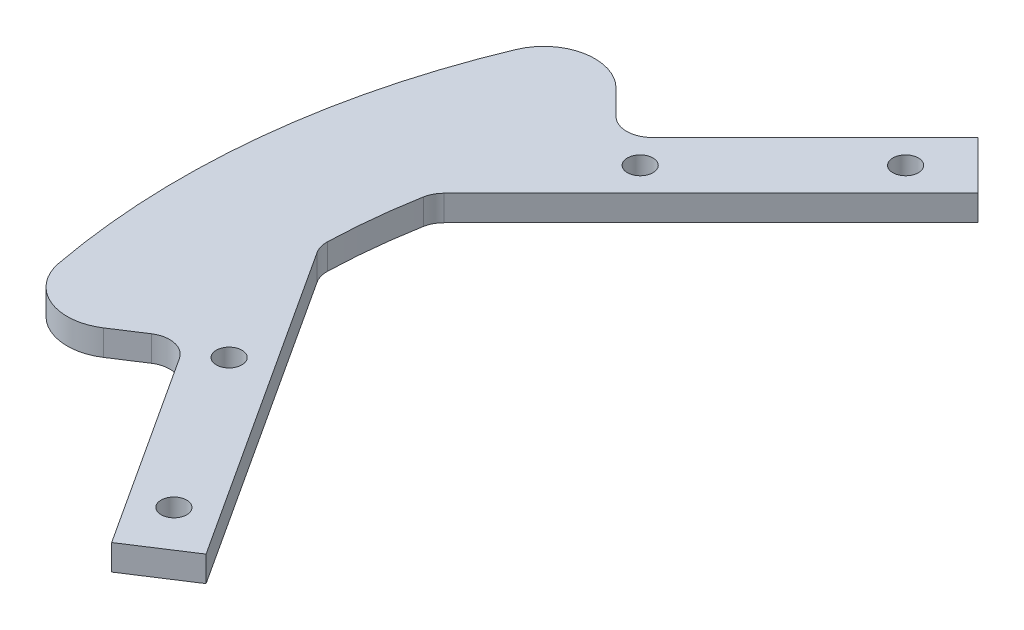
ISO-10303-21;
HEADER;
FILE_DESCRIPTION(('STEP AP214'),'2;1');
FILE_NAME('part.step','',(''),(''),'','','');
FILE_SCHEMA(('AUTOMOTIVE_DESIGN { 1 0 10303 214 1 1 1 1 }'));
ENDSEC;
DATA;
#1=APPLICATION_CONTEXT('core data for automotive mechanical design processes');
#2=APPLICATION_PROTOCOL_DEFINITION('international standard','automotive_design',2000,#1);
#3=PRODUCT_CONTEXT('',#1,'mechanical');
#4=PRODUCT('Part','Part','',(#3));
#5=PRODUCT_RELATED_PRODUCT_CATEGORY('part','',(#4));
#6=PRODUCT_DEFINITION_FORMATION('','',#4);
#7=PRODUCT_DEFINITION_CONTEXT('part definition',#1,'design');
#8=PRODUCT_DEFINITION('design','',#6,#7);
#9=PRODUCT_DEFINITION_SHAPE('','',#8);
#10=(LENGTH_UNIT() NAMED_UNIT(*) SI_UNIT(.MILLI.,.METRE.));
#11=(NAMED_UNIT(*) PLANE_ANGLE_UNIT() SI_UNIT($,.RADIAN.));
#12=(NAMED_UNIT(*) SI_UNIT($,.STERADIAN.) SOLID_ANGLE_UNIT());
#13=UNCERTAINTY_MEASURE_WITH_UNIT(LENGTH_MEASURE(1.E-05),#10,'distance_accuracy_value','');
#14=(GEOMETRIC_REPRESENTATION_CONTEXT(3) GLOBAL_UNCERTAINTY_ASSIGNED_CONTEXT((#13)) GLOBAL_UNIT_ASSIGNED_CONTEXT((#10,
#11,#12)) REPRESENTATION_CONTEXT('',''));
#15=CARTESIAN_POINT('',(0.,0.,0.));
#16=DIRECTION('',(0.,0.,1.));
#17=DIRECTION('',(1.,0.,0.));
#18=AXIS2_PLACEMENT_3D('',#15,#16,#17);
#19=CARTESIAN_POINT('',(0.,3.,0.));
#20=DIRECTION('',(0.,1.,0.));
#21=DIRECTION('',(0.,0.,1.));
#22=AXIS2_PLACEMENT_3D('',#19,#20,#21);
#23=PLANE('',#22);
#24=CARTESIAN_POINT('',(-51.9975752126165,3.,33.7676201709314));
#25=DIRECTION('',(0.,1.,0.));
#26=DIRECTION('',(0.,0.,1.));
#27=AXIS2_PLACEMENT_3D('',#24,#25,#26);
#28=CIRCLE('',#27,1.5);
#29=CARTESIAN_POINT('',(-51.9975752126165,3.,35.2676201709314));
#30=VERTEX_POINT('',#29);
#31=EDGE_CURVE('E523',#30,#30,#28,.T.);
#32=ORIENTED_EDGE('',*,*,#31,.F.);
#33=EDGE_LOOP('',(#32));
#34=FACE_BOUND('',#33,.T.);
#35=CARTESIAN_POINT('',(-43.8406204335662,3.,-43.8406204335657));
#36=DIRECTION('',(0.,1.,0.));
#37=DIRECTION('',(0.,0.,1.));
#38=AXIS2_PLACEMENT_3D('',#35,#36,#37);
#39=CIRCLE('',#38,1.5);
#40=CARTESIAN_POINT('',(-43.8406204335662,3.,-42.3406204335657));
#41=VERTEX_POINT('',#40);
#42=EDGE_CURVE('E192',#41,#41,#39,.T.);
#43=ORIENTED_EDGE('',*,*,#42,.F.);
#44=EDGE_LOOP('',(#43));
#45=FACE_BOUND('',#44,.T.);
#46=DIRECTION('',(-0.707106781186544,0.,0.707106781186551));
#47=VECTOR('',#46,1.);
#48=CARTESIAN_POINT('',(-63.6396103067894,3.,-29.6984848098347));
#49=LINE('',#48,#47);
#50=CARTESIAN_POINT('',(-42.4264068711931,3.,-50.9116882454312));
#51=VERTEX_POINT('',#50);
#52=CARTESIAN_POINT('',(-61.5182899632298,3.,-31.8198051533943));
#53=VERTEX_POINT('',#52);
#54=EDGE_CURVE('E183',#51,#53,#49,.T.);
#55=ORIENTED_EDGE('',*,*,#54,.T.);
#56=CARTESIAN_POINT('',(-63.6396103067894,3.,-33.941125496954));
#57=DIRECTION('',(0.,1.,0.));
#58=DIRECTION('',(0.,0.,1.));
#59=AXIS2_PLACEMENT_3D('',#56,#57,#58);
#60=CIRCLE('',#59,3.);
#61=CARTESIAN_POINT('',(-65.7609306503491,3.,-31.8198051533943));
#62=VERTEX_POINT('',#61);
#63=EDGE_CURVE('E266',#53,#62,#60,.F.);
#64=ORIENTED_EDGE('',*,*,#63,.T.);
#65=DIRECTION('',(-0.707106781186552,0.,-0.707106781186543));
#66=VECTOR('',#65,1.);
#67=CARTESIAN_POINT('',(-74.6290400089809,3.,-40.687914512026));
#68=LINE('',#67,#66);
#69=CARTESIAN_POINT('',(-68.6474434592942,3.,-34.7063179623394));
#70=VERTEX_POINT('',#69);
#71=EDGE_CURVE('E185',#62,#70,#68,.T.);
#72=ORIENTED_EDGE('',*,*,#71,.T.);
#73=CARTESIAN_POINT('',(-72.8900841464135,3.,-30.4636772752201));
#74=DIRECTION('',(0.,1.,0.));
#75=DIRECTION('',(0.,0.,1.));
#76=AXIS2_PLACEMENT_3D('',#73,#74,#75);
#77=CIRCLE('',#76,6.);
#78=CARTESIAN_POINT('',(-78.4260399043689,3.,-32.7773742834647));
#79=VERTEX_POINT('',#78);
#80=EDGE_CURVE('E233',#70,#79,#77,.T.);
#81=ORIENTED_EDGE('',*,*,#80,.T.);
#82=CARTESIAN_POINT('',(0.,3.,0.));
#83=DIRECTION('',(0.,1.,0.));
#84=DIRECTION('',(0.,0.,1.));
#85=AXIS2_PLACEMENT_3D('',#82,#83,#84);
#86=CIRCLE('',#85,85.);
#87=CARTESIAN_POINT('',(-83.5270420753539,3.,15.7554194530665));
#88=VERTEX_POINT('',#87);
#89=EDGE_CURVE('E212',#79,#88,#86,.T.);
#90=ORIENTED_EDGE('',*,*,#89,.T.);
#91=CARTESIAN_POINT('',(-77.6310155759171,3.,14.6432721975559));
#92=DIRECTION('',(0.,1.,0.));
#93=DIRECTION('',(0.,0.,1.));
#94=AXIS2_PLACEMENT_3D('',#91,#92,#93);
#95=CIRCLE('',#94,6.);
#96=CARTESIAN_POINT('',(-74.363181365827,3.,19.6752956052285));
#97=VERTEX_POINT('',#96);
#98=EDGE_CURVE('E231',#88,#97,#95,.T.);
#99=ORIENTED_EDGE('',*,*,#98,.T.);
#100=DIRECTION('',(0.838670567945427,0.,-0.544639035015022));
#101=VECTOR('',#100,1.);
#102=CARTESIAN_POINT('',(-68.4235943247587,3.,15.8180826803013));
#103=LINE('',#102,#101);
#104=CARTESIAN_POINT('',(-70.939606028595,3.,17.4519997853463));
#105=VERTEX_POINT('',#104);
#106=EDGE_CURVE('E157',#97,#105,#103,.T.);
#107=ORIENTED_EDGE('',*,*,#106,.T.);
#108=CARTESIAN_POINT('',(-69.3056889235499,3.,19.9680114891826));
#109=DIRECTION('',(0.,1.,0.));
#110=DIRECTION('',(0.,0.,1.));
#111=AXIS2_PLACEMENT_3D('',#108,#109,#110);
#112=CIRCLE('',#111,3.);
#113=CARTESIAN_POINT('',(-66.7896772197137,3.,18.3340943841376));
#114=VERTEX_POINT('',#113);
#115=EDGE_CURVE('E11',#105,#114,#112,.F.);
#116=ORIENTED_EDGE('',*,*,#115,.T.);
#117=DIRECTION('',(0.544639035015023,0.,0.838670567945427));
#118=VECTOR('',#117,1.);
#119=CARTESIAN_POINT('',(-52.0844232743081,3.,40.978199718664));
#120=LINE('',#119,#118);
#121=CARTESIAN_POINT('',(-52.0844232743081,3.,40.978199718664));
#122=VERTEX_POINT('',#121);
#123=EDGE_CURVE('E145',#114,#122,#120,.T.);
#124=ORIENTED_EDGE('',*,*,#123,.T.);
#125=DIRECTION('',(0.838670567945427,0.,-0.544639035015022));
#126=VECTOR('',#125,1.);
#127=CARTESIAN_POINT('',(-45.3750587307446,3.,36.6210874385439));
#128=LINE('',#127,#126);
#129=CARTESIAN_POINT('',(-45.3750587307446,3.,36.6210874385439));
#130=VERTEX_POINT('',#129);
#131=EDGE_CURVE('E151',#122,#130,#128,.T.);
#132=ORIENTED_EDGE('',*,*,#131,.T.);
#133=DIRECTION('',(-0.544639035015023,0.,-0.838670567945426));
#134=VECTOR('',#133,1.);
#135=CARTESIAN_POINT('',(-69.9882966174528,3.,-1.27997522923208));
#136=LINE('',#135,#134);
#137=CARTESIAN_POINT('',(-69.4820094592601,3.,-0.500361372701859));
#138=VERTEX_POINT('',#137);
#139=EDGE_CURVE('E171',#130,#138,#136,.T.);
#140=ORIENTED_EDGE('',*,*,#139,.T.);
#141=CARTESIAN_POINT('',(-66.9659977554238,3.,-2.13427847774693));
#142=DIRECTION('',(0.,1.,0.));
#143=DIRECTION('',(0.,0.,1.));
#144=AXIS2_PLACEMENT_3D('',#141,#142,#143);
#145=CIRCLE('',#144,3.);
#146=CARTESIAN_POINT('',(-69.9644752668607,3.,-2.22984318570574));
#147=VERTEX_POINT('',#146);
#148=EDGE_CURVE('E258',#138,#147,#145,.F.);
#149=ORIENTED_EDGE('',*,*,#148,.T.);
#150=CARTESIAN_POINT('',(0.,3.,0.));
#151=DIRECTION('',(0.,-1.,0.));
#152=DIRECTION('',(0.,0.,1.));
#153=AXIS2_PLACEMENT_3D('',#150,#151,#152);
#154=CIRCLE('',#153,70.);
#155=CARTESIAN_POINT('',(-68.899194085878,3.,-12.3653165877995));
#156=VERTEX_POINT('',#155);
#157=EDGE_CURVE('E173',#147,#156,#154,.T.);
#158=ORIENTED_EDGE('',*,*,#157,.T.);
#159=CARTESIAN_POINT('',(-65.9463714821975,3.,-11.8353744483224));
#160=DIRECTION('',(0.,1.,0.));
#161=DIRECTION('',(0.,0.,1.));
#162=AXIS2_PLACEMENT_3D('',#159,#160,#161);
#163=CIRCLE('',#162,3.);
#164=CARTESIAN_POINT('',(-68.0676918257572,3.,-13.956694791882));
#165=VERTEX_POINT('',#164);
#166=EDGE_CURVE('E262',#156,#165,#163,.F.);
#167=ORIENTED_EDGE('',*,*,#166,.T.);
#168=DIRECTION('',(0.707106781186543,0.,-0.707106781186551));
#169=VECTOR('',#168,1.);
#170=CARTESIAN_POINT('',(-36.7695526217007,3.,-45.2548339959388));
#171=LINE('',#170,#169);
#172=CARTESIAN_POINT('',(-36.7695526217007,3.,-45.2548339959388));
#173=VERTEX_POINT('',#172);
#174=EDGE_CURVE('E179',#165,#173,#171,.T.);
#175=ORIENTED_EDGE('',*,*,#174,.T.);
#176=DIRECTION('',(-0.707106781186551,0.,-0.707106781186544));
#177=VECTOR('',#176,1.);
#178=CARTESIAN_POINT('',(-42.4264068711931,3.,-50.9116882454312));
#179=LINE('',#178,#177);
#180=EDGE_CURVE('E181',#173,#51,#179,.T.);
#181=ORIENTED_EDGE('',*,*,#180,.T.);
#182=EDGE_LOOP('',(#55,#64,#72,#81,#90,#99,#107,#116,#124,#132,#140,#149,#158,#167,#175,#181));
#183=FACE_BOUND('',#182,.T.);
#184=CARTESIAN_POINT('',(-59.3969696196702,3.,-28.2842712474616));
#185=DIRECTION('',(0.,1.,0.));
#186=DIRECTION('',(0.,0.,1.));
#187=AXIS2_PLACEMENT_3D('',#184,#185,#186);
#188=CIRCLE('',#187,1.5);
#189=CARTESIAN_POINT('',(-59.3969696196702,3.,-26.7842712474616));
#190=VERTEX_POINT('',#189);
#191=EDGE_CURVE('E517',#190,#190,#188,.T.);
#192=ORIENTED_EDGE('',*,*,#191,.F.);
#193=EDGE_LOOP('',(#192));
#194=FACE_BOUND('',#193,.T.);
#195=CARTESIAN_POINT('',(-63.979633982947,3.,15.316867676132));
#196=DIRECTION('',(0.,1.,0.));
#197=DIRECTION('',(0.,0.,1.));
#198=AXIS2_PLACEMENT_3D('',#195,#196,#197);
#199=CIRCLE('',#198,1.5);
#200=CARTESIAN_POINT('',(-63.979633982947,3.,16.816867676132));
#201=VERTEX_POINT('',#200);
#202=EDGE_CURVE('E529',#201,#201,#199,.T.);
#203=ORIENTED_EDGE('',*,*,#202,.F.);
#204=EDGE_LOOP('',(#203));
#205=FACE_BOUND('',#204,.T.);
#206=ADVANCED_FACE('F33',(#34,#45,#183,#194,#205),#23,.T.);
#207=CARTESIAN_POINT('',(0.,0.,0.));
#208=DIRECTION('',(0.,1.,0.));
#209=DIRECTION('',(0.,0.,1.));
#210=AXIS2_PLACEMENT_3D('',#207,#208,#209);
#211=PLANE('',#210);
#212=CARTESIAN_POINT('',(-51.9975752126165,0.,33.7676201709314));
#213=DIRECTION('',(0.,1.,0.));
#214=DIRECTION('',(0.,0.,1.));
#215=AXIS2_PLACEMENT_3D('',#212,#213,#214);
#216=CIRCLE('',#215,1.5);
#217=CARTESIAN_POINT('',(-51.9975752126165,0.,35.2676201709314));
#218=VERTEX_POINT('',#217);
#219=EDGE_CURVE('E526',#218,#218,#216,.T.);
#220=ORIENTED_EDGE('',*,*,#219,.T.);
#221=EDGE_LOOP('',(#220));
#222=FACE_BOUND('',#221,.T.);
#223=CARTESIAN_POINT('',(-43.8406204335662,0.,-43.8406204335657));
#224=DIRECTION('',(0.,1.,0.));
#225=DIRECTION('',(0.,0.,1.));
#226=AXIS2_PLACEMENT_3D('',#223,#224,#225);
#227=CIRCLE('',#226,1.5);
#228=CARTESIAN_POINT('',(-43.8406204335662,0.,-42.3406204335657));
#229=VERTEX_POINT('',#228);
#230=EDGE_CURVE('E514',#229,#229,#227,.T.);
#231=ORIENTED_EDGE('',*,*,#230,.T.);
#232=EDGE_LOOP('',(#231));
#233=FACE_BOUND('',#232,.T.);
#234=CARTESIAN_POINT('',(0.,0.,0.));
#235=DIRECTION('',(0.,1.,0.));
#236=DIRECTION('',(0.,0.,1.));
#237=AXIS2_PLACEMENT_3D('',#234,#235,#236);
#238=CIRCLE('',#237,85.);
#239=CARTESIAN_POINT('',(-78.4260399043689,0.,-32.7773742834647));
#240=VERTEX_POINT('',#239);
#241=CARTESIAN_POINT('',(-83.5270420753539,0.,15.7554194530665));
#242=VERTEX_POINT('',#241);
#243=EDGE_CURVE('E188',#240,#242,#238,.T.);
#244=ORIENTED_EDGE('',*,*,#243,.F.);
#245=CARTESIAN_POINT('',(-72.8900841464135,0.,-30.4636772752201));
#246=DIRECTION('',(0.,1.,0.));
#247=DIRECTION('',(0.,0.,1.));
#248=AXIS2_PLACEMENT_3D('',#245,#246,#247);
#249=CIRCLE('',#248,6.);
#250=CARTESIAN_POINT('',(-68.6474434592942,0.,-34.7063179623394));
#251=VERTEX_POINT('',#250);
#252=EDGE_CURVE('E225',#240,#251,#249,.F.);
#253=ORIENTED_EDGE('',*,*,#252,.T.);
#254=DIRECTION('',(-0.707106781186552,0.,-0.707106781186543));
#255=VECTOR('',#254,1.);
#256=CARTESIAN_POINT('',(-74.6290400089809,0.,-40.687914512026));
#257=LINE('',#256,#255);
#258=CARTESIAN_POINT('',(-65.7609306503491,0.,-31.8198051533943));
#259=VERTEX_POINT('',#258);
#260=EDGE_CURVE('E210',#259,#251,#257,.T.);
#261=ORIENTED_EDGE('',*,*,#260,.F.);
#262=CARTESIAN_POINT('',(-63.6396103067894,0.,-33.941125496954));
#263=DIRECTION('',(0.,1.,0.));
#264=DIRECTION('',(0.,0.,1.));
#265=AXIS2_PLACEMENT_3D('',#262,#263,#264);
#266=CIRCLE('',#265,3.);
#267=CARTESIAN_POINT('',(-61.5182899632298,0.,-31.8198051533943));
#268=VERTEX_POINT('',#267);
#269=EDGE_CURVE('E264',#259,#268,#266,.T.);
#270=ORIENTED_EDGE('',*,*,#269,.T.);
#271=DIRECTION('',(-0.707106781186544,0.,0.707106781186551));
#272=VECTOR('',#271,1.);
#273=CARTESIAN_POINT('',(-63.6396103067894,0.,-29.6984848098347));
#274=LINE('',#273,#272);
#275=CARTESIAN_POINT('',(-42.4264068711931,0.,-50.9116882454312));
#276=VERTEX_POINT('',#275);
#277=EDGE_CURVE('E207',#276,#268,#274,.T.);
#278=ORIENTED_EDGE('',*,*,#277,.F.);
#279=DIRECTION('',(-0.707106781186551,0.,-0.707106781186544));
#280=VECTOR('',#279,1.);
#281=CARTESIAN_POINT('',(-42.4264068711931,0.,-50.9116882454312));
#282=LINE('',#281,#280);
#283=CARTESIAN_POINT('',(-36.7695526217007,0.,-45.2548339959388));
#284=VERTEX_POINT('',#283);
#285=EDGE_CURVE('E205',#284,#276,#282,.T.);
#286=ORIENTED_EDGE('',*,*,#285,.F.);
#287=DIRECTION('',(0.707106781186543,0.,-0.707106781186551));
#288=VECTOR('',#287,1.);
#289=CARTESIAN_POINT('',(-36.7695526217007,0.,-45.2548339959388));
#290=LINE('',#289,#288);
#291=CARTESIAN_POINT('',(-68.0676918257572,0.,-13.956694791882));
#292=VERTEX_POINT('',#291);
#293=EDGE_CURVE('E203',#292,#284,#290,.T.);
#294=ORIENTED_EDGE('',*,*,#293,.F.);
#295=CARTESIAN_POINT('',(-65.9463714821975,0.,-11.8353744483224));
#296=DIRECTION('',(0.,1.,0.));
#297=DIRECTION('',(0.,0.,1.));
#298=AXIS2_PLACEMENT_3D('',#295,#296,#297);
#299=CIRCLE('',#298,3.);
#300=CARTESIAN_POINT('',(-68.899194085878,0.,-12.3653165877995));
#301=VERTEX_POINT('',#300);
#302=EDGE_CURVE('E260',#292,#301,#299,.T.);
#303=ORIENTED_EDGE('',*,*,#302,.T.);
#304=CARTESIAN_POINT('',(0.,0.,0.));
#305=DIRECTION('',(0.,-1.,0.));
#306=DIRECTION('',(0.,0.,1.));
#307=AXIS2_PLACEMENT_3D('',#304,#305,#306);
#308=CIRCLE('',#307,70.);
#309=CARTESIAN_POINT('',(-69.9644752668607,0.,-2.22984318570574));
#310=VERTEX_POINT('',#309);
#311=EDGE_CURVE('E200',#310,#301,#308,.T.);
#312=ORIENTED_EDGE('',*,*,#311,.F.);
#313=CARTESIAN_POINT('',(-66.9659977554238,0.,-2.13427847774693));
#314=DIRECTION('',(0.,1.,0.));
#315=DIRECTION('',(0.,0.,1.));
#316=AXIS2_PLACEMENT_3D('',#313,#314,#315);
#317=CIRCLE('',#316,3.);
#318=CARTESIAN_POINT('',(-69.4820094592601,0.,-0.500361372701859));
#319=VERTEX_POINT('',#318);
#320=EDGE_CURVE('E256',#310,#319,#317,.T.);
#321=ORIENTED_EDGE('',*,*,#320,.T.);
#322=DIRECTION('',(-0.544639035015023,0.,-0.838670567945426));
#323=VECTOR('',#322,1.);
#324=CARTESIAN_POINT('',(-69.9882966174528,0.,-1.27997522923208));
#325=LINE('',#324,#323);
#326=CARTESIAN_POINT('',(-45.3750587307446,0.,36.6210874385439));
#327=VERTEX_POINT('',#326);
#328=EDGE_CURVE('E197',#327,#319,#325,.T.);
#329=ORIENTED_EDGE('',*,*,#328,.F.);
#330=DIRECTION('',(0.838670567945427,0.,-0.544639035015022));
#331=VECTOR('',#330,1.);
#332=CARTESIAN_POINT('',(-45.3750587307446,0.,36.6210874385439));
#333=LINE('',#332,#331);
#334=CARTESIAN_POINT('',(-52.0844232743081,0.,40.978199718664));
#335=VERTEX_POINT('',#334);
#336=EDGE_CURVE('E195',#335,#327,#333,.T.);
#337=ORIENTED_EDGE('',*,*,#336,.F.);
#338=DIRECTION('',(0.544639035015023,0.,0.838670567945427));
#339=VECTOR('',#338,1.);
#340=CARTESIAN_POINT('',(-52.0844232743081,0.,40.978199718664));
#341=LINE('',#340,#339);
#342=CARTESIAN_POINT('',(-66.7896772197137,0.,18.3340943841376));
#343=VERTEX_POINT('',#342);
#344=EDGE_CURVE('E162',#343,#335,#341,.T.);
#345=ORIENTED_EDGE('',*,*,#344,.F.);
#346=CARTESIAN_POINT('',(-69.3056889235499,0.,19.9680114891826));
#347=DIRECTION('',(0.,1.,0.));
#348=DIRECTION('',(0.,0.,1.));
#349=AXIS2_PLACEMENT_3D('',#346,#347,#348);
#350=CIRCLE('',#349,3.);
#351=CARTESIAN_POINT('',(-70.939606028595,0.,17.4519997853463));
#352=VERTEX_POINT('',#351);
#353=EDGE_CURVE('E41',#343,#352,#350,.T.);
#354=ORIENTED_EDGE('',*,*,#353,.T.);
#355=DIRECTION('',(0.838670567945427,0.,-0.544639035015022));
#356=VECTOR('',#355,1.);
#357=CARTESIAN_POINT('',(-68.4235943247587,0.,15.8180826803013));
#358=LINE('',#357,#356);
#359=CARTESIAN_POINT('',(-74.363181365827,0.,19.6752956052285));
#360=VERTEX_POINT('',#359);
#361=EDGE_CURVE('E191',#360,#352,#358,.T.);
#362=ORIENTED_EDGE('',*,*,#361,.F.);
#363=CARTESIAN_POINT('',(-77.6310155759171,0.,14.6432721975559));
#364=DIRECTION('',(0.,1.,0.));
#365=DIRECTION('',(0.,0.,1.));
#366=AXIS2_PLACEMENT_3D('',#363,#364,#365);
#367=CIRCLE('',#366,6.);
#368=EDGE_CURVE('E223',#360,#242,#367,.F.);
#369=ORIENTED_EDGE('',*,*,#368,.T.);
#370=EDGE_LOOP('',(#244,#253,#261,#270,#278,#286,#294,#303,#312,#321,#329,#337,#345,#354,#362,#369));
#371=FACE_BOUND('',#370,.T.);
#372=CARTESIAN_POINT('',(-59.3969696196702,0.,-28.2842712474616));
#373=DIRECTION('',(0.,1.,0.));
#374=DIRECTION('',(0.,0.,1.));
#375=AXIS2_PLACEMENT_3D('',#372,#373,#374);
#376=CIRCLE('',#375,1.5);
#377=CARTESIAN_POINT('',(-59.3969696196702,0.,-26.7842712474616));
#378=VERTEX_POINT('',#377);
#379=EDGE_CURVE('E520',#378,#378,#376,.T.);
#380=ORIENTED_EDGE('',*,*,#379,.T.);
#381=EDGE_LOOP('',(#380));
#382=FACE_BOUND('',#381,.T.);
#383=CARTESIAN_POINT('',(-63.979633982947,0.,15.316867676132));
#384=DIRECTION('',(0.,1.,0.));
#385=DIRECTION('',(0.,0.,1.));
#386=AXIS2_PLACEMENT_3D('',#383,#384,#385);
#387=CIRCLE('',#386,1.5);
#388=CARTESIAN_POINT('',(-63.979633982947,0.,16.816867676132));
#389=VERTEX_POINT('',#388);
#390=EDGE_CURVE('E532',#389,#389,#387,.T.);
#391=ORIENTED_EDGE('',*,*,#390,.T.);
#392=EDGE_LOOP('',(#391));
#393=FACE_BOUND('',#392,.T.);
#394=ADVANCED_FACE('F281',(#222,#233,#371,#382,#393),#211,.F.);
#395=CARTESIAN_POINT('',(0.,3.,0.));
#396=DIRECTION('',(0.,-1.,0.));
#397=DIRECTION('',(0.,0.,-1.));
#398=AXIS2_PLACEMENT_3D('',#395,#396,#397);
#399=CYLINDRICAL_SURFACE('',#398,85.);
#400=ORIENTED_EDGE('',*,*,#89,.F.);
#401=DIRECTION('',(0.,-1.,0.));
#402=VECTOR('',#401,1.);
#403=CARTESIAN_POINT('',(-78.426039904369,3.,-32.7773742834647));
#404=LINE('',#403,#402);
#405=EDGE_CURVE('E220',#79,#240,#404,.T.);
#406=ORIENTED_EDGE('',*,*,#405,.T.);
#407=ORIENTED_EDGE('',*,*,#243,.T.);
#408=DIRECTION('',(0.,-1.,0.));
#409=VECTOR('',#408,1.);
#410=CARTESIAN_POINT('',(-83.5270420753539,3.,15.7554194530665));
#411=LINE('',#410,#409);
#412=EDGE_CURVE('E165',#242,#88,#411,.F.);
#413=ORIENTED_EDGE('',*,*,#412,.T.);
#414=EDGE_LOOP('',(#400,#406,#407,#413));
#415=FACE_BOUND('',#414,.T.);
#416=ADVANCED_FACE('F326',(#415),#399,.T.);
#417=CARTESIAN_POINT('',(-68.4235943247587,3.,15.8180826803013));
#418=DIRECTION('',(-0.544639035015022,0.,-0.838670567945427));
#419=DIRECTION('',(-0.838670567945427,0.,0.544639035015022));
#420=AXIS2_PLACEMENT_3D('',#417,#418,#419);
#421=PLANE('',#420);
#422=ORIENTED_EDGE('',*,*,#361,.T.);
#423=DIRECTION('',(0.,-1.,0.));
#424=VECTOR('',#423,1.);
#425=CARTESIAN_POINT('',(-70.939606028595,3.,17.4519997853463));
#426=LINE('',#425,#424);
#427=EDGE_CURVE('E54',#352,#105,#426,.F.);
#428=ORIENTED_EDGE('',*,*,#427,.T.);
#429=ORIENTED_EDGE('',*,*,#106,.F.);
#430=DIRECTION('',(0.,-1.,0.));
#431=VECTOR('',#430,1.);
#432=CARTESIAN_POINT('',(-74.363181365827,3.,19.6752956052285));
#433=LINE('',#432,#431);
#434=EDGE_CURVE('E235',#97,#360,#433,.T.);
#435=ORIENTED_EDGE('',*,*,#434,.T.);
#436=EDGE_LOOP('',(#422,#428,#429,#435));
#437=FACE_BOUND('',#436,.T.);
#438=ADVANCED_FACE('F476',(#437),#421,.F.);
#439=CARTESIAN_POINT('',(-52.0844232743081,3.,40.978199718664));
#440=DIRECTION('',(0.838670567945427,0.,-0.544639035015023));
#441=DIRECTION('',(-0.544639035015023,0.,-0.838670567945427));
#442=AXIS2_PLACEMENT_3D('',#439,#440,#441);
#443=PLANE('',#442);
#444=ORIENTED_EDGE('',*,*,#123,.F.);
#445=DIRECTION('',(0.,-1.,0.));
#446=VECTOR('',#445,1.);
#447=CARTESIAN_POINT('',(-66.7896772197137,0.,18.3340943841376));
#448=LINE('',#447,#446);
#449=EDGE_CURVE('E253',#114,#343,#448,.T.);
#450=ORIENTED_EDGE('',*,*,#449,.T.);
#451=ORIENTED_EDGE('',*,*,#344,.T.);
#452=DIRECTION('',(0.,-1.,0.));
#453=VECTOR('',#452,1.);
#454=CARTESIAN_POINT('',(-52.0844232743081,3.,40.978199718664));
#455=LINE('',#454,#453);
#456=EDGE_CURVE('E160',#122,#335,#455,.T.);
#457=ORIENTED_EDGE('',*,*,#456,.F.);
#458=EDGE_LOOP('',(#444,#450,#451,#457));
#459=FACE_BOUND('',#458,.T.);
#460=ADVANCED_FACE('F161',(#459),#443,.F.);
#461=CARTESIAN_POINT('',(-45.3750587307446,3.,36.6210874385439));
#462=DIRECTION('',(-0.544639035015022,0.,-0.838670567945427));
#463=DIRECTION('',(-0.838670567945427,0.,0.544639035015022));
#464=AXIS2_PLACEMENT_3D('',#461,#462,#463);
#465=PLANE('',#464);
#466=ORIENTED_EDGE('',*,*,#336,.T.);
#467=DIRECTION('',(0.,-1.,0.));
#468=VECTOR('',#467,1.);
#469=CARTESIAN_POINT('',(-45.3750587307446,3.,36.6210874385439));
#470=LINE('',#469,#468);
#471=EDGE_CURVE('E166',#130,#327,#470,.T.);
#472=ORIENTED_EDGE('',*,*,#471,.F.);
#473=ORIENTED_EDGE('',*,*,#131,.F.);
#474=ORIENTED_EDGE('',*,*,#456,.T.);
#475=EDGE_LOOP('',(#466,#472,#473,#474));
#476=FACE_BOUND('',#475,.T.);
#477=ADVANCED_FACE('F168',(#476),#465,.F.);
#478=CARTESIAN_POINT('',(-69.9882966174528,3.,-1.27997522923208));
#479=DIRECTION('',(-0.838670567945426,0.,0.544639035015023));
#480=DIRECTION('',(0.544639035015023,0.,0.838670567945426));
#481=AXIS2_PLACEMENT_3D('',#478,#479,#480);
#482=PLANE('',#481);
#483=ORIENTED_EDGE('',*,*,#328,.T.);
#484=DIRECTION('',(0.,1.,0.));
#485=VECTOR('',#484,1.);
#486=CARTESIAN_POINT('',(-69.4820094592601,3.,-0.50036137270186));
#487=LINE('',#486,#485);
#488=EDGE_CURVE('E243',#319,#138,#487,.T.);
#489=ORIENTED_EDGE('',*,*,#488,.T.);
#490=ORIENTED_EDGE('',*,*,#139,.F.);
#491=ORIENTED_EDGE('',*,*,#471,.T.);
#492=EDGE_LOOP('',(#483,#489,#490,#491));
#493=FACE_BOUND('',#492,.T.);
#494=ADVANCED_FACE('F311',(#493),#482,.F.);
#495=CARTESIAN_POINT('',(0.,3.,0.));
#496=DIRECTION('',(0.,-1.,0.));
#497=DIRECTION('',(0.,0.,-1.));
#498=AXIS2_PLACEMENT_3D('',#495,#496,#497);
#499=CYLINDRICAL_SURFACE('',#498,70.);
#500=ORIENTED_EDGE('',*,*,#157,.F.);
#501=DIRECTION('',(0.,-1.,0.));
#502=VECTOR('',#501,1.);
#503=CARTESIAN_POINT('',(-69.9644752668607,3.,-2.22984318570574));
#504=LINE('',#503,#502);
#505=EDGE_CURVE('E240',#147,#310,#504,.T.);
#506=ORIENTED_EDGE('',*,*,#505,.T.);
#507=ORIENTED_EDGE('',*,*,#311,.T.);
#508=DIRECTION('',(0.,-1.,0.));
#509=VECTOR('',#508,1.);
#510=CARTESIAN_POINT('',(-68.8991940858781,3.,-12.3653165877995));
#511=LINE('',#510,#509);
#512=EDGE_CURVE('E238',#301,#156,#511,.F.);
#513=ORIENTED_EDGE('',*,*,#512,.T.);
#514=EDGE_LOOP('',(#500,#506,#507,#513));
#515=FACE_BOUND('',#514,.T.);
#516=ADVANCED_FACE('F303',(#515),#499,.F.);
#517=CARTESIAN_POINT('',(-36.7695526217007,3.,-45.2548339959388));
#518=DIRECTION('',(-0.707106781186552,0.,-0.707106781186543));
#519=DIRECTION('',(-0.707106781186543,0.,0.707106781186552));
#520=AXIS2_PLACEMENT_3D('',#517,#518,#519);
#521=PLANE('',#520);
#522=ORIENTED_EDGE('',*,*,#174,.F.);
#523=DIRECTION('',(0.,1.,0.));
#524=VECTOR('',#523,1.);
#525=CARTESIAN_POINT('',(-68.0676918257572,0.,-13.956694791882));
#526=LINE('',#525,#524);
#527=EDGE_CURVE('E245',#165,#292,#526,.F.);
#528=ORIENTED_EDGE('',*,*,#527,.T.);
#529=ORIENTED_EDGE('',*,*,#293,.T.);
#530=DIRECTION('',(0.,-1.,0.));
#531=VECTOR('',#530,1.);
#532=CARTESIAN_POINT('',(-36.7695526217007,3.,-45.2548339959388));
#533=LINE('',#532,#531);
#534=EDGE_CURVE('E215',#173,#284,#533,.T.);
#535=ORIENTED_EDGE('',*,*,#534,.F.);
#536=EDGE_LOOP('',(#522,#528,#529,#535));
#537=FACE_BOUND('',#536,.T.);
#538=ADVANCED_FACE('F295',(#537),#521,.F.);
#539=CARTESIAN_POINT('',(-42.4264068711931,3.,-50.9116882454312));
#540=DIRECTION('',(-0.707106781186544,0.,0.707106781186551));
#541=DIRECTION('',(0.707106781186551,0.,0.707106781186544));
#542=AXIS2_PLACEMENT_3D('',#539,#540,#541);
#543=PLANE('',#542);
#544=ORIENTED_EDGE('',*,*,#285,.T.);
#545=DIRECTION('',(0.,-1.,0.));
#546=VECTOR('',#545,1.);
#547=CARTESIAN_POINT('',(-42.4264068711931,3.,-50.9116882454312));
#548=LINE('',#547,#546);
#549=EDGE_CURVE('E187',#51,#276,#548,.T.);
#550=ORIENTED_EDGE('',*,*,#549,.F.);
#551=ORIENTED_EDGE('',*,*,#180,.F.);
#552=ORIENTED_EDGE('',*,*,#534,.T.);
#553=EDGE_LOOP('',(#544,#550,#551,#552));
#554=FACE_BOUND('',#553,.T.);
#555=ADVANCED_FACE('F289',(#554),#543,.F.);
#556=CARTESIAN_POINT('',(-63.6396103067894,3.,-29.6984848098347));
#557=DIRECTION('',(0.707106781186551,0.,0.707106781186544));
#558=DIRECTION('',(0.707106781186544,0.,-0.707106781186551));
#559=AXIS2_PLACEMENT_3D('',#556,#557,#558);
#560=PLANE('',#559);
#561=ORIENTED_EDGE('',*,*,#277,.T.);
#562=DIRECTION('',(0.,-1.,0.));
#563=VECTOR('',#562,1.);
#564=CARTESIAN_POINT('',(-61.5182899632298,3.,-31.8198051533943));
#565=LINE('',#564,#563);
#566=EDGE_CURVE('E251',#268,#53,#565,.F.);
#567=ORIENTED_EDGE('',*,*,#566,.T.);
#568=ORIENTED_EDGE('',*,*,#54,.F.);
#569=ORIENTED_EDGE('',*,*,#549,.T.);
#570=EDGE_LOOP('',(#561,#567,#568,#569));
#571=FACE_BOUND('',#570,.T.);
#572=ADVANCED_FACE('F285',(#571),#560,.F.);
#573=CARTESIAN_POINT('',(-74.6290400089809,3.,-40.687914512026));
#574=DIRECTION('',(-0.707106781186543,0.,0.707106781186552));
#575=DIRECTION('',(0.707106781186552,0.,0.707106781186543));
#576=AXIS2_PLACEMENT_3D('',#573,#574,#575);
#577=PLANE('',#576);
#578=ORIENTED_EDGE('',*,*,#71,.F.);
#579=DIRECTION('',(0.,-1.,0.));
#580=VECTOR('',#579,1.);
#581=CARTESIAN_POINT('',(-65.7609306503491,0.,-31.8198051533943));
#582=LINE('',#581,#580);
#583=EDGE_CURVE('E248',#62,#259,#582,.T.);
#584=ORIENTED_EDGE('',*,*,#583,.T.);
#585=ORIENTED_EDGE('',*,*,#260,.T.);
#586=DIRECTION('',(0.,-1.,0.));
#587=VECTOR('',#586,1.);
#588=CARTESIAN_POINT('',(-68.6474434592942,3.,-34.7063179623394));
#589=LINE('',#588,#587);
#590=EDGE_CURVE('E228',#251,#70,#589,.F.);
#591=ORIENTED_EDGE('',*,*,#590,.T.);
#592=EDGE_LOOP('',(#578,#584,#585,#591));
#593=FACE_BOUND('',#592,.T.);
#594=ADVANCED_FACE('F274',(#593),#577,.F.);
#595=CARTESIAN_POINT('',(-43.8406204335662,3.,-43.8406204335657));
#596=DIRECTION('',(0.,-1.,0.));
#597=DIRECTION('',(0.,0.,-1.));
#598=AXIS2_PLACEMENT_3D('',#595,#596,#597);
#599=CYLINDRICAL_SURFACE('',#598,1.5);
#600=ORIENTED_EDGE('',*,*,#42,.T.);
#601=EDGE_LOOP('',(#600));
#602=FACE_BOUND('',#601,.T.);
#603=ORIENTED_EDGE('',*,*,#230,.F.);
#604=EDGE_LOOP('',(#603));
#605=FACE_BOUND('',#604,.T.);
#606=ADVANCED_FACE('F332',(#602,#605),#599,.F.);
#607=CARTESIAN_POINT('',(-59.3969696196702,3.,-28.2842712474616));
#608=DIRECTION('',(0.,-1.,0.));
#609=DIRECTION('',(0.,0.,-1.));
#610=AXIS2_PLACEMENT_3D('',#607,#608,#609);
#611=CYLINDRICAL_SURFACE('',#610,1.5);
#612=ORIENTED_EDGE('',*,*,#191,.T.);
#613=EDGE_LOOP('',(#612));
#614=FACE_BOUND('',#613,.T.);
#615=ORIENTED_EDGE('',*,*,#379,.F.);
#616=EDGE_LOOP('',(#615));
#617=FACE_BOUND('',#616,.T.);
#618=ADVANCED_FACE('F366',(#614,#617),#611,.F.);
#619=CARTESIAN_POINT('',(-51.9975752126165,3.,33.7676201709314));
#620=DIRECTION('',(0.,-1.,0.));
#621=DIRECTION('',(0.,0.,-1.));
#622=AXIS2_PLACEMENT_3D('',#619,#620,#621);
#623=CYLINDRICAL_SURFACE('',#622,1.5);
#624=ORIENTED_EDGE('',*,*,#31,.T.);
#625=EDGE_LOOP('',(#624));
#626=FACE_BOUND('',#625,.T.);
#627=ORIENTED_EDGE('',*,*,#219,.F.);
#628=EDGE_LOOP('',(#627));
#629=FACE_BOUND('',#628,.T.);
#630=ADVANCED_FACE('F373',(#626,#629),#623,.F.);
#631=CARTESIAN_POINT('',(-63.979633982947,3.,15.316867676132));
#632=DIRECTION('',(0.,-1.,0.));
#633=DIRECTION('',(0.,0.,-1.));
#634=AXIS2_PLACEMENT_3D('',#631,#632,#633);
#635=CYLINDRICAL_SURFACE('',#634,1.5);
#636=ORIENTED_EDGE('',*,*,#202,.T.);
#637=EDGE_LOOP('',(#636));
#638=FACE_BOUND('',#637,.T.);
#639=ORIENTED_EDGE('',*,*,#390,.F.);
#640=EDGE_LOOP('',(#639));
#641=FACE_BOUND('',#640,.T.);
#642=ADVANCED_FACE('F380',(#638,#641),#635,.F.);
#643=CARTESIAN_POINT('',(-72.8900841464135,3.,-30.4636772752201));
#644=DIRECTION('',(0.,-1.,0.));
#645=DIRECTION('',(0.,0.,-1.));
#646=AXIS2_PLACEMENT_3D('',#643,#644,#645);
#647=CYLINDRICAL_SURFACE('',#646,6.);
#648=ORIENTED_EDGE('',*,*,#80,.F.);
#649=ORIENTED_EDGE('',*,*,#590,.F.);
#650=ORIENTED_EDGE('',*,*,#252,.F.);
#651=ORIENTED_EDGE('',*,*,#405,.F.);
#652=EDGE_LOOP('',(#648,#649,#650,#651));
#653=FACE_BOUND('',#652,.T.);
#654=ADVANCED_FACE('F388',(#653),#647,.T.);
#655=CARTESIAN_POINT('',(-77.6310155759171,3.,14.6432721975559));
#656=DIRECTION('',(0.,-1.,0.));
#657=DIRECTION('',(0.,0.,-1.));
#658=AXIS2_PLACEMENT_3D('',#655,#656,#657);
#659=CYLINDRICAL_SURFACE('',#658,6.);
#660=ORIENTED_EDGE('',*,*,#98,.F.);
#661=ORIENTED_EDGE('',*,*,#412,.F.);
#662=ORIENTED_EDGE('',*,*,#368,.F.);
#663=ORIENTED_EDGE('',*,*,#434,.F.);
#664=EDGE_LOOP('',(#660,#661,#662,#663));
#665=FACE_BOUND('',#664,.T.);
#666=ADVANCED_FACE('F397',(#665),#659,.T.);
#667=CARTESIAN_POINT('',(-66.9659977554238,3.,-2.13427847774693));
#668=DIRECTION('',(0.,-1.,0.));
#669=DIRECTION('',(0.,0.,-1.));
#670=AXIS2_PLACEMENT_3D('',#667,#668,#669);
#671=CYLINDRICAL_SURFACE('',#670,3.);
#672=ORIENTED_EDGE('',*,*,#148,.F.);
#673=ORIENTED_EDGE('',*,*,#488,.F.);
#674=ORIENTED_EDGE('',*,*,#320,.F.);
#675=ORIENTED_EDGE('',*,*,#505,.F.);
#676=EDGE_LOOP('',(#672,#673,#674,#675));
#677=FACE_BOUND('',#676,.T.);
#678=ADVANCED_FACE('F308',(#677),#671,.F.);
#679=CARTESIAN_POINT('',(-65.9463714821975,3.,-11.8353744483224));
#680=DIRECTION('',(0.,-1.,0.));
#681=DIRECTION('',(0.,0.,-1.));
#682=AXIS2_PLACEMENT_3D('',#679,#680,#681);
#683=CYLINDRICAL_SURFACE('',#682,3.);
#684=ORIENTED_EDGE('',*,*,#166,.F.);
#685=ORIENTED_EDGE('',*,*,#512,.F.);
#686=ORIENTED_EDGE('',*,*,#302,.F.);
#687=ORIENTED_EDGE('',*,*,#527,.F.);
#688=EDGE_LOOP('',(#684,#685,#686,#687));
#689=FACE_BOUND('',#688,.T.);
#690=ADVANCED_FACE('F299',(#689),#683,.F.);
#691=CARTESIAN_POINT('',(-63.6396103067894,3.,-33.941125496954));
#692=DIRECTION('',(0.,1.,0.));
#693=DIRECTION('',(0.,0.,1.));
#694=AXIS2_PLACEMENT_3D('',#691,#692,#693);
#695=CYLINDRICAL_SURFACE('',#694,3.);
#696=ORIENTED_EDGE('',*,*,#63,.F.);
#697=ORIENTED_EDGE('',*,*,#566,.F.);
#698=ORIENTED_EDGE('',*,*,#269,.F.);
#699=ORIENTED_EDGE('',*,*,#583,.F.);
#700=EDGE_LOOP('',(#696,#697,#698,#699));
#701=FACE_BOUND('',#700,.T.);
#702=ADVANCED_FACE('F278',(#701),#695,.F.);
#703=CARTESIAN_POINT('',(-69.3056889235499,3.,19.9680114891826));
#704=DIRECTION('',(0.,1.,0.));
#705=DIRECTION('',(0.,0.,1.));
#706=AXIS2_PLACEMENT_3D('',#703,#704,#705);
#707=CYLINDRICAL_SURFACE('',#706,3.);
#708=ORIENTED_EDGE('',*,*,#115,.F.);
#709=ORIENTED_EDGE('',*,*,#427,.F.);
#710=ORIENTED_EDGE('',*,*,#353,.F.);
#711=ORIENTED_EDGE('',*,*,#449,.F.);
#712=EDGE_LOOP('',(#708,#709,#710,#711));
#713=FACE_BOUND('',#712,.T.);
#714=ADVANCED_FACE('F35',(#713),#707,.F.);
#715=CLOSED_SHELL('',(#206,#394,#416,#438,#460,#477,#494,#516,#538,#555,#572,#594,#606,#618,
#630,#642,#654,#666,#678,#690,#702,#714));
#716=MANIFOLD_SOLID_BREP('B2',#715);
#717=ADVANCED_BREP_SHAPE_REPRESENTATION('',(#18,#716),#14);
#718=SHAPE_DEFINITION_REPRESENTATION(#9,#717);
ENDSEC;
END-ISO-10303-21;
